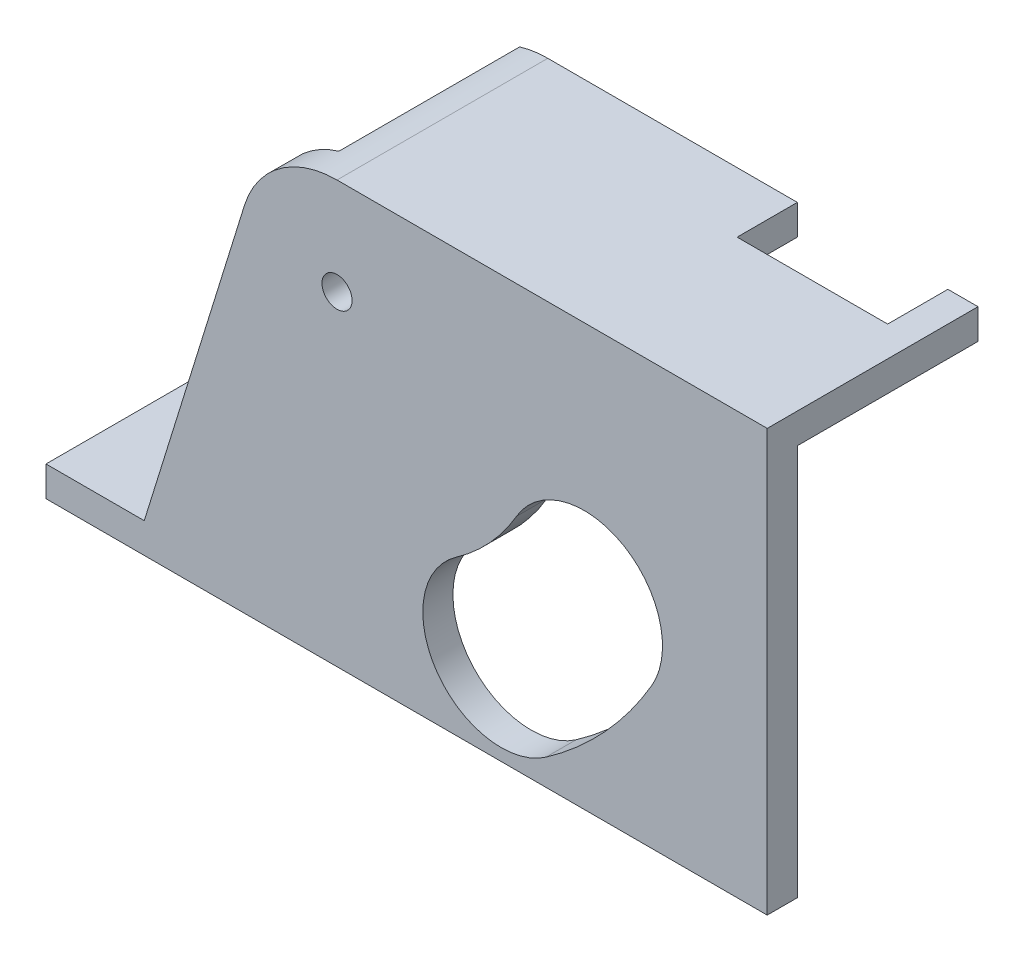
ISO-10303-21;
HEADER;
FILE_DESCRIPTION(('STEP AP214'),'2;1');
FILE_NAME('part.step','',(''),(''),'','','');
FILE_SCHEMA(('AUTOMOTIVE_DESIGN { 1 0 10303 214 1 1 1 1 }'));
ENDSEC;
DATA;
#1=APPLICATION_CONTEXT('core data for automotive mechanical design processes');
#2=APPLICATION_PROTOCOL_DEFINITION('international standard','automotive_design',2000,#1);
#3=PRODUCT_CONTEXT('',#1,'mechanical');
#4=PRODUCT('Part','Part','',(#3));
#5=PRODUCT_RELATED_PRODUCT_CATEGORY('part','',(#4));
#6=PRODUCT_DEFINITION_FORMATION('','',#4);
#7=PRODUCT_DEFINITION_CONTEXT('part definition',#1,'design');
#8=PRODUCT_DEFINITION('design','',#6,#7);
#9=PRODUCT_DEFINITION_SHAPE('','',#8);
#10=(LENGTH_UNIT() NAMED_UNIT(*) SI_UNIT(.MILLI.,.METRE.));
#11=(NAMED_UNIT(*) PLANE_ANGLE_UNIT() SI_UNIT($,.RADIAN.));
#12=(NAMED_UNIT(*) SI_UNIT($,.STERADIAN.) SOLID_ANGLE_UNIT());
#13=UNCERTAINTY_MEASURE_WITH_UNIT(LENGTH_MEASURE(1.E-05),#10,'distance_accuracy_value','');
#14=(GEOMETRIC_REPRESENTATION_CONTEXT(3) GLOBAL_UNCERTAINTY_ASSIGNED_CONTEXT((#13)) GLOBAL_UNIT_ASSIGNED_CONTEXT((#10,
#11,#12)) REPRESENTATION_CONTEXT('',''));
#15=CARTESIAN_POINT('',(0.,0.,0.));
#16=DIRECTION('',(0.,0.,1.));
#17=DIRECTION('',(1.,0.,0.));
#18=AXIS2_PLACEMENT_3D('',#15,#16,#17);
#19=CARTESIAN_POINT('',(48.5613886077065,58.9097221037272,-30.));
#20=DIRECTION('',(0.,0.,1.));
#21=DIRECTION('',(1.,0.,0.));
#22=AXIS2_PLACEMENT_3D('',#19,#20,#21);
#23=PLANE('',#22);
#24=DIRECTION('',(-1.,0.,0.));
#25=VECTOR('',#24,1.);
#26=CARTESIAN_POINT('',(120.,65.,-30.));
#27=LINE('',#26,#25);
#28=CARTESIAN_POINT('',(120.,65.,-30.));
#29=VERTEX_POINT('',#28);
#30=CARTESIAN_POINT('',(115.,65.,-30.));
#31=VERTEX_POINT('',#30);
#32=EDGE_CURVE('E200',#29,#31,#27,.T.);
#33=ORIENTED_EDGE('',*,*,#32,.T.);
#34=DIRECTION('',(0.,1.,0.));
#35=VECTOR('',#34,1.);
#36=CARTESIAN_POINT('',(115.,58.9097221037273,-30.));
#37=LINE('',#36,#35);
#38=CARTESIAN_POINT('',(115.,70.,-30.));
#39=VERTEX_POINT('',#38);
#40=EDGE_CURVE('E41',#31,#39,#37,.T.);
#41=ORIENTED_EDGE('',*,*,#40,.T.);
#42=DIRECTION('',(1.,0.,0.));
#43=VECTOR('',#42,1.);
#44=CARTESIAN_POINT('',(120.,70.,-30.));
#45=LINE('',#44,#43);
#46=CARTESIAN_POINT('',(120.,70.,-30.));
#47=VERTEX_POINT('',#46);
#48=EDGE_CURVE('E198',#39,#47,#45,.T.);
#49=ORIENTED_EDGE('',*,*,#48,.T.);
#50=DIRECTION('',(0.,-1.,0.));
#51=VECTOR('',#50,1.);
#52=CARTESIAN_POINT('',(120.,70.,-30.));
#53=LINE('',#52,#51);
#54=EDGE_CURVE('E226',#47,#29,#53,.T.);
#55=ORIENTED_EDGE('',*,*,#54,.T.);
#56=EDGE_LOOP('',(#33,#41,#49,#55));
#57=FACE_BOUND('',#56,.T.);
#58=ADVANCED_FACE('F33',(#57),#23,.F.);
#59=CARTESIAN_POINT('',(0.,0.,0.));
#60=DIRECTION('',(0.,0.,-1.));
#61=DIRECTION('',(-1.,0.,0.));
#62=AXIS2_PLACEMENT_3D('',#59,#60,#61);
#63=PLANE('',#62);
#64=CARTESIAN_POINT('',(75.8062693343812,15.,0.));
#65=DIRECTION('',(0.,0.,1.));
#66=DIRECTION('',(1.,0.,0.));
#67=AXIS2_PLACEMENT_3D('',#64,#65,#66);
#68=CIRCLE('',#67,13.);
#69=CARTESIAN_POINT('',(68.3497756618176,25.6489765757569,0.));
#70=VERTEX_POINT('',#69);
#71=CARTESIAN_POINT('',(83.2627630069448,4.35102342424313,0.));
#72=VERTEX_POINT('',#71);
#73=EDGE_CURVE('E252',#70,#72,#68,.T.);
#74=ORIENTED_EDGE('',*,*,#73,.T.);
#75=CARTESIAN_POINT('',(48.5613886077065,53.9097221037271,0.));
#76=DIRECTION('',(0.,0.,1.));
#77=DIRECTION('',(1.,0.,0.));
#78=AXIS2_PLACEMENT_3D('',#75,#76,#77);
#79=CIRCLE('',#78,60.5);
#80=CARTESIAN_POINT('',(100.837944203235,23.4562865821378,0.));
#81=VERTEX_POINT('',#80);
#82=EDGE_CURVE('E255',#72,#81,#79,.T.);
#83=ORIENTED_EDGE('',*,*,#82,.T.);
#84=CARTESIAN_POINT('',(89.6049653149398,30.,0.));
#85=DIRECTION('',(0.,0.,1.));
#86=DIRECTION('',(1.,0.,0.));
#87=AXIS2_PLACEMENT_3D('',#84,#85,#86);
#88=CIRCLE('',#87,13.);
#89=CARTESIAN_POINT('',(78.3719864266444,36.5437134178622,0.));
#90=VERTEX_POINT('',#89);
#91=EDGE_CURVE('E259',#81,#90,#88,.T.);
#92=ORIENTED_EDGE('',*,*,#91,.T.);
#93=CARTESIAN_POINT('',(48.5613886077065,53.9097221037271,0.));
#94=DIRECTION('',(0.,0.,-1.));
#95=DIRECTION('',(1.,0.,0.));
#96=AXIS2_PLACEMENT_3D('',#93,#94,#95);
#97=CIRCLE('',#96,34.5);
#98=EDGE_CURVE('E262',#90,#70,#97,.T.);
#99=ORIENTED_EDGE('',*,*,#98,.T.);
#100=EDGE_LOOP('',(#74,#83,#92,#99));
#101=FACE_BOUND('',#100,.T.);
#102=CARTESIAN_POINT('',(48.5613886077065,53.9097221037271,0.));
#103=DIRECTION('',(0.,0.,1.));
#104=DIRECTION('',(1.,0.,0.));
#105=AXIS2_PLACEMENT_3D('',#102,#103,#104);
#106=CIRCLE('',#105,2.5);
#107=CARTESIAN_POINT('',(51.0613886077065,53.9097221037271,0.));
#108=VERTEX_POINT('',#107);
#109=EDGE_CURVE('E269',#108,#108,#106,.T.);
#110=ORIENTED_EDGE('',*,*,#109,.T.);
#111=EDGE_LOOP('',(#110));
#112=FACE_BOUND('',#111,.T.);
#113=DIRECTION('',(-0.296153592749173,-0.9551403297431,0.));
#114=VECTOR('',#113,1.);
#115=CARTESIAN_POINT('',(37.2069506060173,54.7376581656054,0.));
#116=LINE('',#115,#114);
#117=CARTESIAN_POINT('',(37.2069506060173,54.7376581656054,0.));
#118=VERTEX_POINT('',#117);
#119=CARTESIAN_POINT('',(20.2348328766987,0.,0.));
#120=VERTEX_POINT('',#119);
#121=EDGE_CURVE('E363',#118,#120,#116,.T.);
#122=ORIENTED_EDGE('',*,*,#121,.F.);
#123=DIRECTION('',(0.864075299099649,-0.503362570604781,0.));
#124=VECTOR('',#123,1.);
#125=CARTESIAN_POINT('',(37.2069506060173,54.7376581656054,0.));
#126=LINE('',#125,#124);
#127=CARTESIAN_POINT('',(32.7730020651153,57.320631822882,0.));
#128=VERTEX_POINT('',#127);
#129=EDGE_CURVE('E359',#128,#118,#126,.T.);
#130=ORIENTED_EDGE('',*,*,#129,.F.);
#131=DIRECTION('',(-0.296153592749172,-0.9551403297431,0.));
#132=VECTOR('',#131,1.);
#133=CARTESIAN_POINT('',(13.6843957425264,-4.24302360349572,0.));
#134=LINE('',#133,#132);
#135=CARTESIAN_POINT('',(33.1929152722023,58.6749157110409,0.));
#136=VERTEX_POINT('',#135);
#137=EDGE_CURVE('E302',#136,#128,#134,.T.);
#138=ORIENTED_EDGE('',*,*,#137,.F.);
#139=CARTESIAN_POINT('',(48.5613886077065,53.9097221037271,0.));
#140=DIRECTION('',(0.,0.,-1.));
#141=DIRECTION('',(-1.,0.,0.));
#142=AXIS2_PLACEMENT_3D('',#139,#140,#141);
#143=CIRCLE('',#142,16.0902778962729);
#144=CARTESIAN_POINT('',(43.8850469520508,69.3054640962024,0.));
#145=VERTEX_POINT('',#144);
#146=EDGE_CURVE('E305',#145,#136,#143,.F.);
#147=ORIENTED_EDGE('',*,*,#146,.F.);
#148=DIRECTION('',(-0.573576436351043,0.819152044288994,0.));
#149=VECTOR('',#148,1.);
#150=CARTESIAN_POINT('',(47.0357374309038,64.8058117689672,0.));
#151=LINE('',#150,#149);
#152=CARTESIAN_POINT('',(47.0357374309038,64.8058117689672,0.));
#153=VERTEX_POINT('',#152);
#154=EDGE_CURVE('E223',#153,#145,#151,.T.);
#155=ORIENTED_EDGE('',*,*,#154,.F.);
#156=CARTESIAN_POINT('',(48.5613886077065,58.9097221037272,0.));
#157=DIRECTION('',(0.,0.,1.));
#158=DIRECTION('',(1.,0.,0.));
#159=AXIS2_PLACEMENT_3D('',#156,#157,#158);
#160=CIRCLE('',#159,6.09027789627276);
#161=CARTESIAN_POINT('',(48.5613886077065,65.,0.));
#162=VERTEX_POINT('',#161);
#163=EDGE_CURVE('E219',#162,#153,#160,.T.);
#164=ORIENTED_EDGE('',*,*,#163,.F.);
#165=DIRECTION('',(-1.,0.,0.));
#166=VECTOR('',#165,1.);
#167=CARTESIAN_POINT('',(120.,65.,0.));
#168=LINE('',#167,#166);
#169=CARTESIAN_POINT('',(120.,65.,0.));
#170=VERTEX_POINT('',#169);
#171=EDGE_CURVE('E216',#170,#162,#168,.T.);
#172=ORIENTED_EDGE('',*,*,#171,.F.);
#173=DIRECTION('',(0.,1.,0.));
#174=VECTOR('',#173,1.);
#175=CARTESIAN_POINT('',(120.,0.,0.));
#176=LINE('',#175,#174);
#177=CARTESIAN_POINT('',(120.,0.,0.));
#178=VERTEX_POINT('',#177);
#179=EDGE_CURVE('E293',#178,#170,#176,.T.);
#180=ORIENTED_EDGE('',*,*,#179,.F.);
#181=DIRECTION('',(1.,0.,0.));
#182=VECTOR('',#181,1.);
#183=CARTESIAN_POINT('',(0.,0.,0.));
#184=LINE('',#183,#182);
#185=EDGE_CURVE('E279',#120,#178,#184,.T.);
#186=ORIENTED_EDGE('',*,*,#185,.F.);
#187=EDGE_LOOP('',(#122,#130,#138,#147,#155,#164,#172,#180,#186));
#188=FACE_BOUND('',#187,.T.);
#189=ADVANCED_FACE('F387',(#101,#112,#188),#63,.T.);
#190=CARTESIAN_POINT('',(0.,0.,5.));
#191=DIRECTION('',(0.,1.,0.));
#192=DIRECTION('',(0.,0.,1.));
#193=AXIS2_PLACEMENT_3D('',#190,#191,#192);
#194=PLANE('',#193);
#195=DIRECTION('',(0.,0.,-1.));
#196=VECTOR('',#195,1.);
#197=CARTESIAN_POINT('',(120.,0.,5.));
#198=LINE('',#197,#196);
#199=CARTESIAN_POINT('',(120.,0.,5.));
#200=VERTEX_POINT('',#199);
#201=EDGE_CURVE('E296',#200,#178,#198,.T.);
#202=ORIENTED_EDGE('',*,*,#201,.F.);
#203=DIRECTION('',(1.,0.,0.));
#204=VECTOR('',#203,1.);
#205=CARTESIAN_POINT('',(0.,0.,5.));
#206=LINE('',#205,#204);
#207=CARTESIAN_POINT('',(0.234832876698662,0.,5.));
#208=VERTEX_POINT('',#207);
#209=EDGE_CURVE('E290',#208,#200,#206,.T.);
#210=ORIENTED_EDGE('',*,*,#209,.F.);
#211=DIRECTION('',(0.,0.,-1.));
#212=VECTOR('',#211,1.);
#213=CARTESIAN_POINT('',(0.234832876698662,0.,5.));
#214=LINE('',#213,#212);
#215=CARTESIAN_POINT('',(0.234832876698662,0.,-30.));
#216=VERTEX_POINT('',#215);
#217=EDGE_CURVE('E349',#208,#216,#214,.T.);
#218=ORIENTED_EDGE('',*,*,#217,.T.);
#219=DIRECTION('',(-1.,0.,0.));
#220=VECTOR('',#219,1.);
#221=CARTESIAN_POINT('',(20.2348328766987,0.,-30.));
#222=LINE('',#221,#220);
#223=CARTESIAN_POINT('',(20.2348328766987,0.,-30.));
#224=VERTEX_POINT('',#223);
#225=EDGE_CURVE('E360',#224,#216,#222,.T.);
#226=ORIENTED_EDGE('',*,*,#225,.F.);
#227=DIRECTION('',(0.,0.,1.));
#228=VECTOR('',#227,1.);
#229=CARTESIAN_POINT('',(20.2348328766987,0.,-30.));
#230=LINE('',#229,#228);
#231=EDGE_CURVE('E369',#224,#120,#230,.T.);
#232=ORIENTED_EDGE('',*,*,#231,.T.);
#233=ORIENTED_EDGE('',*,*,#185,.T.);
#234=EDGE_LOOP('',(#202,#210,#218,#226,#232,#233));
#235=FACE_BOUND('',#234,.T.);
#236=ADVANCED_FACE('F35',(#235),#194,.F.);
#237=CARTESIAN_POINT('',(120.,0.,5.));
#238=DIRECTION('',(-1.,0.,0.));
#239=DIRECTION('',(0.,-1.,0.));
#240=AXIS2_PLACEMENT_3D('',#237,#238,#239);
#241=PLANE('',#240);
#242=ORIENTED_EDGE('',*,*,#179,.T.);
#243=DIRECTION('',(0.,0.,1.));
#244=VECTOR('',#243,1.);
#245=CARTESIAN_POINT('',(120.,65.,-30.));
#246=LINE('',#245,#244);
#247=EDGE_CURVE('E235',#29,#170,#246,.T.);
#248=ORIENTED_EDGE('',*,*,#247,.F.);
#249=ORIENTED_EDGE('',*,*,#54,.F.);
#250=DIRECTION('',(0.,0.,1.));
#251=VECTOR('',#250,1.);
#252=CARTESIAN_POINT('',(120.,70.,-5.));
#253=LINE('',#252,#251);
#254=CARTESIAN_POINT('',(120.,70.,5.));
#255=VERTEX_POINT('',#254);
#256=EDGE_CURVE('E204',#47,#255,#253,.T.);
#257=ORIENTED_EDGE('',*,*,#256,.T.);
#258=DIRECTION('',(0.,1.,0.));
#259=VECTOR('',#258,1.);
#260=CARTESIAN_POINT('',(120.,0.,5.));
#261=LINE('',#260,#259);
#262=EDGE_CURVE('E292',#200,#255,#261,.T.);
#263=ORIENTED_EDGE('',*,*,#262,.F.);
#264=ORIENTED_EDGE('',*,*,#201,.T.);
#265=EDGE_LOOP('',(#242,#248,#249,#257,#263,#264));
#266=FACE_BOUND('',#265,.T.);
#267=ADVANCED_FACE('F400',(#266),#241,.F.);
#268=CARTESIAN_POINT('',(0.,0.,5.));
#269=DIRECTION('',(0.,0.,-1.));
#270=DIRECTION('',(-1.,0.,0.));
#271=AXIS2_PLACEMENT_3D('',#268,#269,#270);
#272=PLANE('',#271);
#273=ORIENTED_EDGE('',*,*,#209,.T.);
#274=ORIENTED_EDGE('',*,*,#262,.T.);
#275=DIRECTION('',(1.,0.,0.));
#276=VECTOR('',#275,1.);
#277=CARTESIAN_POINT('',(120.,70.,5.));
#278=LINE('',#277,#276);
#279=CARTESIAN_POINT('',(48.5613886077065,70.,5.));
#280=VERTEX_POINT('',#279);
#281=EDGE_CURVE('E243',#280,#255,#278,.T.);
#282=ORIENTED_EDGE('',*,*,#281,.F.);
#283=CARTESIAN_POINT('',(48.5613886077065,53.9097221037271,5.));
#284=DIRECTION('',(0.,0.,-1.));
#285=DIRECTION('',(1.,0.,0.));
#286=AXIS2_PLACEMENT_3D('',#283,#284,#285);
#287=CIRCLE('',#286,16.0902778962729);
#288=CARTESIAN_POINT('',(33.1929152722023,58.6749157110409,5.));
#289=VERTEX_POINT('',#288);
#290=EDGE_CURVE('E240',#289,#280,#287,.T.);
#291=ORIENTED_EDGE('',*,*,#290,.F.);
#292=DIRECTION('',(0.296153592749172,0.9551403297431,0.));
#293=VECTOR('',#292,1.);
#294=CARTESIAN_POINT('',(33.1929152722023,58.6749157110409,5.));
#295=LINE('',#294,#293);
#296=CARTESIAN_POINT('',(16.5503145638758,4.99999999999999,5.));
#297=VERTEX_POINT('',#296);
#298=EDGE_CURVE('E238',#297,#289,#295,.T.);
#299=ORIENTED_EDGE('',*,*,#298,.F.);
#300=DIRECTION('',(1.,0.,0.));
#301=VECTOR('',#300,1.);
#302=CARTESIAN_POINT('',(20.2348328766987,5.,5.));
#303=LINE('',#302,#301);
#304=CARTESIAN_POINT('',(0.234832876698662,5.,5.));
#305=VERTEX_POINT('',#304);
#306=EDGE_CURVE('E347',#305,#297,#303,.T.);
#307=ORIENTED_EDGE('',*,*,#306,.F.);
#308=DIRECTION('',(0.,1.,0.));
#309=VECTOR('',#308,1.);
#310=CARTESIAN_POINT('',(0.234832876698662,0.,5.));
#311=LINE('',#310,#309);
#312=EDGE_CURVE('E344',#208,#305,#311,.T.);
#313=ORIENTED_EDGE('',*,*,#312,.F.);
#314=EDGE_LOOP('',(#273,#274,#282,#291,#299,#307,#313));
#315=FACE_BOUND('',#314,.T.);
#316=CARTESIAN_POINT('',(48.5613886077065,53.9097221037271,5.));
#317=DIRECTION('',(0.,0.,1.));
#318=DIRECTION('',(1.,0.,0.));
#319=AXIS2_PLACEMENT_3D('',#316,#317,#318);
#320=CIRCLE('',#319,60.5);
#321=CARTESIAN_POINT('',(83.2627630069448,4.35102342424313,5.));
#322=VERTEX_POINT('',#321);
#323=CARTESIAN_POINT('',(100.837944203235,23.4562865821378,5.));
#324=VERTEX_POINT('',#323);
#325=EDGE_CURVE('E268',#322,#324,#320,.T.);
#326=ORIENTED_EDGE('',*,*,#325,.F.);
#327=CARTESIAN_POINT('',(75.8062693343812,15.,5.));
#328=DIRECTION('',(0.,0.,1.));
#329=DIRECTION('',(1.,0.,0.));
#330=AXIS2_PLACEMENT_3D('',#327,#328,#329);
#331=CIRCLE('',#330,13.);
#332=CARTESIAN_POINT('',(68.3497756618176,25.6489765757569,5.));
#333=VERTEX_POINT('',#332);
#334=EDGE_CURVE('E266',#333,#322,#331,.T.);
#335=ORIENTED_EDGE('',*,*,#334,.F.);
#336=CARTESIAN_POINT('',(48.5613886077065,53.9097221037271,5.));
#337=DIRECTION('',(0.,0.,-1.));
#338=DIRECTION('',(1.,0.,0.));
#339=AXIS2_PLACEMENT_3D('',#336,#337,#338);
#340=CIRCLE('',#339,34.5);
#341=CARTESIAN_POINT('',(78.3719864266444,36.5437134178622,5.));
#342=VERTEX_POINT('',#341);
#343=EDGE_CURVE('E256',#342,#333,#340,.T.);
#344=ORIENTED_EDGE('',*,*,#343,.F.);
#345=CARTESIAN_POINT('',(89.6049653149398,30.,5.));
#346=DIRECTION('',(0.,0.,1.));
#347=DIRECTION('',(1.,0.,0.));
#348=AXIS2_PLACEMENT_3D('',#345,#346,#347);
#349=CIRCLE('',#348,13.);
#350=EDGE_CURVE('E272',#324,#342,#349,.T.);
#351=ORIENTED_EDGE('',*,*,#350,.F.);
#352=EDGE_LOOP('',(#326,#335,#344,#351));
#353=FACE_BOUND('',#352,.T.);
#354=CARTESIAN_POINT('',(48.5613886077065,53.9097221037271,5.));
#355=DIRECTION('',(0.,0.,1.));
#356=DIRECTION('',(1.,0.,0.));
#357=AXIS2_PLACEMENT_3D('',#354,#355,#356);
#358=CIRCLE('',#357,2.5);
#359=CARTESIAN_POINT('',(51.0613886077065,53.9097221037271,5.));
#360=VERTEX_POINT('',#359);
#361=EDGE_CURVE('E247',#360,#360,#358,.T.);
#362=ORIENTED_EDGE('',*,*,#361,.F.);
#363=EDGE_LOOP('',(#362));
#364=FACE_BOUND('',#363,.T.);
#365=ADVANCED_FACE('F393',(#315,#353,#364),#272,.F.);
#366=CARTESIAN_POINT('',(48.5613886077065,53.9097221037271,0.));
#367=DIRECTION('',(0.,0.,1.));
#368=DIRECTION('',(1.,0.,0.));
#369=AXIS2_PLACEMENT_3D('',#366,#367,#368);
#370=CYLINDRICAL_SURFACE('',#369,2.5);
#371=ORIENTED_EDGE('',*,*,#109,.F.);
#372=EDGE_LOOP('',(#371));
#373=FACE_BOUND('',#372,.T.);
#374=ORIENTED_EDGE('',*,*,#361,.T.);
#375=EDGE_LOOP('',(#374));
#376=FACE_BOUND('',#375,.T.);
#377=ADVANCED_FACE('F460',(#373,#376),#370,.F.);
#378=CARTESIAN_POINT('',(75.8062693343812,15.,0.));
#379=DIRECTION('',(0.,0.,1.));
#380=DIRECTION('',(1.,0.,0.));
#381=AXIS2_PLACEMENT_3D('',#378,#379,#380);
#382=CYLINDRICAL_SURFACE('',#381,13.);
#383=ORIENTED_EDGE('',*,*,#334,.T.);
#384=DIRECTION('',(0.,0.,1.));
#385=VECTOR('',#384,1.);
#386=CARTESIAN_POINT('',(83.2627630069448,4.35102342424313,0.));
#387=LINE('',#386,#385);
#388=EDGE_CURVE('E265',#72,#322,#387,.T.);
#389=ORIENTED_EDGE('',*,*,#388,.F.);
#390=ORIENTED_EDGE('',*,*,#73,.F.);
#391=DIRECTION('',(0.,0.,1.));
#392=VECTOR('',#391,1.);
#393=CARTESIAN_POINT('',(68.3497756618176,25.6489765757569,0.));
#394=LINE('',#393,#392);
#395=EDGE_CURVE('E277',#70,#333,#394,.T.);
#396=ORIENTED_EDGE('',*,*,#395,.T.);
#397=EDGE_LOOP('',(#383,#389,#390,#396));
#398=FACE_BOUND('',#397,.T.);
#399=ADVANCED_FACE('F450',(#398),#382,.F.);
#400=CARTESIAN_POINT('',(48.5613886077065,53.9097221037271,0.));
#401=DIRECTION('',(0.,0.,1.));
#402=DIRECTION('',(1.,0.,0.));
#403=AXIS2_PLACEMENT_3D('',#400,#401,#402);
#404=CYLINDRICAL_SURFACE('',#403,34.5);
#405=ORIENTED_EDGE('',*,*,#343,.T.);
#406=ORIENTED_EDGE('',*,*,#395,.F.);
#407=ORIENTED_EDGE('',*,*,#98,.F.);
#408=DIRECTION('',(0.,0.,1.));
#409=VECTOR('',#408,1.);
#410=CARTESIAN_POINT('',(78.3719864266444,36.5437134178622,0.));
#411=LINE('',#410,#409);
#412=EDGE_CURVE('E280',#90,#342,#411,.T.);
#413=ORIENTED_EDGE('',*,*,#412,.T.);
#414=EDGE_LOOP('',(#405,#406,#407,#413));
#415=FACE_BOUND('',#414,.T.);
#416=ADVANCED_FACE('F446',(#415),#404,.T.);
#417=CARTESIAN_POINT('',(89.6049653149398,30.,0.));
#418=DIRECTION('',(0.,0.,1.));
#419=DIRECTION('',(1.,0.,0.));
#420=AXIS2_PLACEMENT_3D('',#417,#418,#419);
#421=CYLINDRICAL_SURFACE('',#420,13.);
#422=ORIENTED_EDGE('',*,*,#350,.T.);
#423=ORIENTED_EDGE('',*,*,#412,.F.);
#424=ORIENTED_EDGE('',*,*,#91,.F.);
#425=DIRECTION('',(0.,0.,1.));
#426=VECTOR('',#425,1.);
#427=CARTESIAN_POINT('',(100.837944203235,23.4562865821378,0.));
#428=LINE('',#427,#426);
#429=EDGE_CURVE('E282',#81,#324,#428,.T.);
#430=ORIENTED_EDGE('',*,*,#429,.T.);
#431=EDGE_LOOP('',(#422,#423,#424,#430));
#432=FACE_BOUND('',#431,.T.);
#433=ADVANCED_FACE('F449',(#432),#421,.F.);
#434=CARTESIAN_POINT('',(48.5613886077065,53.9097221037271,0.));
#435=DIRECTION('',(0.,0.,1.));
#436=DIRECTION('',(1.,0.,0.));
#437=AXIS2_PLACEMENT_3D('',#434,#435,#436);
#438=CYLINDRICAL_SURFACE('',#437,60.5);
#439=ORIENTED_EDGE('',*,*,#325,.T.);
#440=ORIENTED_EDGE('',*,*,#429,.F.);
#441=ORIENTED_EDGE('',*,*,#82,.F.);
#442=ORIENTED_EDGE('',*,*,#388,.T.);
#443=EDGE_LOOP('',(#439,#440,#441,#442));
#444=FACE_BOUND('',#443,.T.);
#445=ADVANCED_FACE('F441',(#444),#438,.F.);
#446=CARTESIAN_POINT('',(120.,70.,-5.));
#447=DIRECTION('',(0.,-1.,0.));
#448=DIRECTION('',(1.,0.,0.));
#449=AXIS2_PLACEMENT_3D('',#446,#447,#448);
#450=PLANE('',#449);
#451=ORIENTED_EDGE('',*,*,#48,.F.);
#452=DIRECTION('',(0.,0.,-1.));
#453=VECTOR('',#452,1.);
#454=CARTESIAN_POINT('',(115.,70.,-30.));
#455=LINE('',#454,#453);
#456=CARTESIAN_POINT('',(115.,70.,-20.));
#457=VERTEX_POINT('',#456);
#458=EDGE_CURVE('E183',#457,#39,#455,.T.);
#459=ORIENTED_EDGE('',*,*,#458,.F.);
#460=DIRECTION('',(1.,0.,0.));
#461=VECTOR('',#460,1.);
#462=CARTESIAN_POINT('',(115.,70.,-20.));
#463=LINE('',#462,#461);
#464=CARTESIAN_POINT('',(90.,70.,-20.));
#465=VERTEX_POINT('',#464);
#466=EDGE_CURVE('E333',#465,#457,#463,.T.);
#467=ORIENTED_EDGE('',*,*,#466,.F.);
#468=DIRECTION('',(0.,0.,1.));
#469=VECTOR('',#468,1.);
#470=CARTESIAN_POINT('',(90.,70.,-30.));
#471=LINE('',#470,#469);
#472=CARTESIAN_POINT('',(90.,70.,-30.));
#473=VERTEX_POINT('',#472);
#474=EDGE_CURVE('E193',#473,#465,#471,.T.);
#475=ORIENTED_EDGE('',*,*,#474,.F.);
#476=CARTESIAN_POINT('',(48.5613886077065,70.,-30.));
#477=VERTEX_POINT('',#476);
#478=EDGE_CURVE('E206',#477,#473,#45,.T.);
#479=ORIENTED_EDGE('',*,*,#478,.F.);
#480=DIRECTION('',(0.,0.,1.));
#481=VECTOR('',#480,1.);
#482=CARTESIAN_POINT('',(48.5613886077065,70.,-5.));
#483=LINE('',#482,#481);
#484=EDGE_CURVE('E248',#477,#280,#483,.T.);
#485=ORIENTED_EDGE('',*,*,#484,.T.);
#486=ORIENTED_EDGE('',*,*,#281,.T.);
#487=ORIENTED_EDGE('',*,*,#256,.F.);
#488=EDGE_LOOP('',(#451,#459,#467,#475,#479,#485,#486,#487));
#489=FACE_BOUND('',#488,.T.);
#490=ADVANCED_FACE('F202',(#489),#450,.F.);
#491=CARTESIAN_POINT('',(48.5613886077065,53.9097221037271,-5.));
#492=DIRECTION('',(0.,0.,1.));
#493=DIRECTION('',(1.,0.,0.));
#494=AXIS2_PLACEMENT_3D('',#491,#492,#493);
#495=CYLINDRICAL_SURFACE('',#494,16.0902778962729);
#496=ORIENTED_EDGE('',*,*,#484,.F.);
#497=CARTESIAN_POINT('',(48.5613886077065,53.9097221037275,-30.));
#498=DIRECTION('',(0.,0.,-1.));
#499=DIRECTION('',(1.,0.,0.));
#500=AXIS2_PLACEMENT_3D('',#497,#498,#499);
#501=CIRCLE('',#500,16.0902778962725);
#502=CARTESIAN_POINT('',(43.8850469520508,69.3054640962024,-30.));
#503=VERTEX_POINT('',#502);
#504=EDGE_CURVE('E207',#503,#477,#501,.T.);
#505=ORIENTED_EDGE('',*,*,#504,.F.);
#506=DIRECTION('',(0.,0.,1.));
#507=VECTOR('',#506,1.);
#508=CARTESIAN_POINT('',(43.8850469520508,69.3054640962024,-30.));
#509=LINE('',#508,#507);
#510=EDGE_CURVE('E210',#503,#145,#509,.T.);
#511=ORIENTED_EDGE('',*,*,#510,.T.);
#512=ORIENTED_EDGE('',*,*,#146,.T.);
#513=DIRECTION('',(0.,0.,1.));
#514=VECTOR('',#513,1.);
#515=CARTESIAN_POINT('',(33.1929152722023,58.6749157110409,-5.));
#516=LINE('',#515,#514);
#517=EDGE_CURVE('E245',#136,#289,#516,.T.);
#518=ORIENTED_EDGE('',*,*,#517,.T.);
#519=ORIENTED_EDGE('',*,*,#290,.T.);
#520=EDGE_LOOP('',(#496,#505,#511,#512,#518,#519));
#521=FACE_BOUND('',#520,.T.);
#522=ADVANCED_FACE('F330',(#521),#495,.T.);
#523=CARTESIAN_POINT('',(33.1929152722023,58.6749157110409,-5.));
#524=DIRECTION('',(0.9551403297431,-0.296153592749172,0.));
#525=DIRECTION('',(0.296153592749172,0.9551403297431,0.));
#526=AXIS2_PLACEMENT_3D('',#523,#524,#525);
#527=PLANE('',#526);
#528=DIRECTION('',(0.296153592749172,0.9551403297431,0.));
#529=VECTOR('',#528,1.);
#530=CARTESIAN_POINT('',(15.,0.,-30.));
#531=LINE('',#530,#529);
#532=CARTESIAN_POINT('',(16.5503145638758,5.,-30.));
#533=VERTEX_POINT('',#532);
#534=CARTESIAN_POINT('',(32.7730020651153,57.320631822882,-30.));
#535=VERTEX_POINT('',#534);
#536=EDGE_CURVE('E362',#533,#535,#531,.T.);
#537=ORIENTED_EDGE('',*,*,#536,.F.);
#538=DIRECTION('',(0.,0.,1.));
#539=VECTOR('',#538,1.);
#540=CARTESIAN_POINT('',(16.5503145638758,5.,-5.));
#541=LINE('',#540,#539);
#542=EDGE_CURVE('E354',#533,#297,#541,.T.);
#543=ORIENTED_EDGE('',*,*,#542,.T.);
#544=ORIENTED_EDGE('',*,*,#298,.T.);
#545=ORIENTED_EDGE('',*,*,#517,.F.);
#546=ORIENTED_EDGE('',*,*,#137,.T.);
#547=DIRECTION('',(0.,0.,1.));
#548=VECTOR('',#547,1.);
#549=CARTESIAN_POINT('',(32.7730020651153,57.320631822882,-30.));
#550=LINE('',#549,#548);
#551=EDGE_CURVE('E220',#535,#128,#550,.T.);
#552=ORIENTED_EDGE('',*,*,#551,.F.);
#553=EDGE_LOOP('',(#537,#543,#544,#545,#546,#552));
#554=FACE_BOUND('',#553,.T.);
#555=ADVANCED_FACE('F390',(#554),#527,.F.);
#556=CARTESIAN_POINT('',(120.,65.,-30.));
#557=DIRECTION('',(0.,1.,0.));
#558=DIRECTION('',(0.,0.,1.));
#559=AXIS2_PLACEMENT_3D('',#556,#557,#558);
#560=PLANE('',#559);
#561=DIRECTION('',(1.,0.,0.));
#562=VECTOR('',#561,1.);
#563=CARTESIAN_POINT('',(120.,65.,-20.));
#564=LINE('',#563,#562);
#565=CARTESIAN_POINT('',(90.,65.,-20.));
#566=VERTEX_POINT('',#565);
#567=CARTESIAN_POINT('',(115.,65.,-20.));
#568=VERTEX_POINT('',#567);
#569=EDGE_CURVE('E11',#566,#568,#564,.T.);
#570=ORIENTED_EDGE('',*,*,#569,.T.);
#571=DIRECTION('',(0.,0.,-1.));
#572=VECTOR('',#571,1.);
#573=CARTESIAN_POINT('',(115.,65.,-30.));
#574=LINE('',#573,#572);
#575=EDGE_CURVE('E341',#568,#31,#574,.T.);
#576=ORIENTED_EDGE('',*,*,#575,.T.);
#577=ORIENTED_EDGE('',*,*,#32,.F.);
#578=ORIENTED_EDGE('',*,*,#247,.T.);
#579=ORIENTED_EDGE('',*,*,#171,.T.);
#580=DIRECTION('',(0.,0.,1.));
#581=VECTOR('',#580,1.);
#582=CARTESIAN_POINT('',(48.5613886077065,65.,-30.));
#583=LINE('',#582,#581);
#584=CARTESIAN_POINT('',(48.5613886077065,65.,-30.));
#585=VERTEX_POINT('',#584);
#586=EDGE_CURVE('E232',#585,#162,#583,.T.);
#587=ORIENTED_EDGE('',*,*,#586,.F.);
#588=CARTESIAN_POINT('',(90.,65.,-30.));
#589=VERTEX_POINT('',#588);
#590=EDGE_CURVE('E310',#589,#585,#27,.T.);
#591=ORIENTED_EDGE('',*,*,#590,.F.);
#592=DIRECTION('',(0.,0.,1.));
#593=VECTOR('',#592,1.);
#594=CARTESIAN_POINT('',(90.,65.,-30.));
#595=LINE('',#594,#593);
#596=EDGE_CURVE('E48',#589,#566,#595,.T.);
#597=ORIENTED_EDGE('',*,*,#596,.T.);
#598=EDGE_LOOP('',(#570,#576,#577,#578,#579,#587,#591,#597));
#599=FACE_BOUND('',#598,.T.);
#600=ADVANCED_FACE('F316',(#599),#560,.F.);
#601=CARTESIAN_POINT('',(48.5613886077065,58.9097221037272,-30.));
#602=DIRECTION('',(0.,0.,1.));
#603=DIRECTION('',(1.,0.,0.));
#604=AXIS2_PLACEMENT_3D('',#601,#602,#603);
#605=CYLINDRICAL_SURFACE('',#604,6.09027789627276);
#606=ORIENTED_EDGE('',*,*,#163,.T.);
#607=DIRECTION('',(0.,0.,1.));
#608=VECTOR('',#607,1.);
#609=CARTESIAN_POINT('',(47.0357374309038,64.8058117689672,-30.));
#610=LINE('',#609,#608);
#611=CARTESIAN_POINT('',(47.0357374309038,64.8058117689672,-30.));
#612=VERTEX_POINT('',#611);
#613=EDGE_CURVE('E229',#612,#153,#610,.T.);
#614=ORIENTED_EDGE('',*,*,#613,.F.);
#615=CARTESIAN_POINT('',(48.5613886077065,58.9097221037272,-30.));
#616=DIRECTION('',(0.,0.,1.));
#617=DIRECTION('',(1.,0.,0.));
#618=AXIS2_PLACEMENT_3D('',#615,#616,#617);
#619=CIRCLE('',#618,6.09027789627276);
#620=EDGE_CURVE('E319',#585,#612,#619,.T.);
#621=ORIENTED_EDGE('',*,*,#620,.F.);
#622=ORIENTED_EDGE('',*,*,#586,.T.);
#623=EDGE_LOOP('',(#606,#614,#621,#622));
#624=FACE_BOUND('',#623,.T.);
#625=ADVANCED_FACE('F432',(#624),#605,.F.);
#626=CARTESIAN_POINT('',(47.0357374309038,64.8058117689672,-30.));
#627=DIRECTION('',(0.819152044288994,0.573576436351043,0.));
#628=DIRECTION('',(-0.573576436351043,0.819152044288994,0.));
#629=AXIS2_PLACEMENT_3D('',#626,#627,#628);
#630=PLANE('',#629);
#631=ORIENTED_EDGE('',*,*,#154,.T.);
#632=ORIENTED_EDGE('',*,*,#510,.F.);
#633=DIRECTION('',(-0.573576436351043,0.819152044288994,0.));
#634=VECTOR('',#633,1.);
#635=CARTESIAN_POINT('',(47.0357374309038,64.8058117689672,-30.));
#636=LINE('',#635,#634);
#637=EDGE_CURVE('E212',#612,#503,#636,.T.);
#638=ORIENTED_EDGE('',*,*,#637,.F.);
#639=ORIENTED_EDGE('',*,*,#613,.T.);
#640=EDGE_LOOP('',(#631,#632,#638,#639));
#641=FACE_BOUND('',#640,.T.);
#642=ADVANCED_FACE('F328',(#641),#630,.F.);
#643=ORIENTED_EDGE('',*,*,#478,.T.);
#644=DIRECTION('',(0.,-1.,0.));
#645=VECTOR('',#644,1.);
#646=CARTESIAN_POINT('',(90.,58.9097221037273,-30.));
#647=LINE('',#646,#645);
#648=EDGE_CURVE('E201',#473,#589,#647,.T.);
#649=ORIENTED_EDGE('',*,*,#648,.T.);
#650=ORIENTED_EDGE('',*,*,#590,.T.);
#651=ORIENTED_EDGE('',*,*,#620,.T.);
#652=ORIENTED_EDGE('',*,*,#637,.T.);
#653=ORIENTED_EDGE('',*,*,#504,.T.);
#654=EDGE_LOOP('',(#643,#649,#650,#651,#652,#653));
#655=FACE_BOUND('',#654,.T.);
#656=ADVANCED_FACE('F309',(#655),#23,.F.);
#657=CARTESIAN_POINT('',(37.2069506060173,54.7376581656054,-30.));
#658=DIRECTION('',(-0.503362570604781,-0.864075299099649,0.));
#659=DIRECTION('',(0.864075299099649,-0.503362570604781,0.));
#660=AXIS2_PLACEMENT_3D('',#657,#658,#659);
#661=PLANE('',#660);
#662=ORIENTED_EDGE('',*,*,#129,.T.);
#663=DIRECTION('',(0.,0.,1.));
#664=VECTOR('',#663,1.);
#665=CARTESIAN_POINT('',(37.2069506060173,54.7376581656054,-30.));
#666=LINE('',#665,#664);
#667=CARTESIAN_POINT('',(37.2069506060173,54.7376581656054,-30.));
#668=VERTEX_POINT('',#667);
#669=EDGE_CURVE('E374',#668,#118,#666,.T.);
#670=ORIENTED_EDGE('',*,*,#669,.F.);
#671=DIRECTION('',(0.864075299099649,-0.503362570604781,0.));
#672=VECTOR('',#671,1.);
#673=CARTESIAN_POINT('',(37.2069506060173,54.7376581656054,-30.));
#674=LINE('',#673,#672);
#675=EDGE_CURVE('E365',#535,#668,#674,.T.);
#676=ORIENTED_EDGE('',*,*,#675,.F.);
#677=ORIENTED_EDGE('',*,*,#551,.T.);
#678=EDGE_LOOP('',(#662,#670,#676,#677));
#679=FACE_BOUND('',#678,.T.);
#680=ADVANCED_FACE('F380',(#679),#661,.F.);
#681=CARTESIAN_POINT('',(37.2069506060173,54.7376581656054,-30.));
#682=DIRECTION('',(-0.9551403297431,0.296153592749172,0.));
#683=DIRECTION('',(-0.296153592749173,-0.9551403297431,0.));
#684=AXIS2_PLACEMENT_3D('',#681,#682,#683);
#685=PLANE('',#684);
#686=ORIENTED_EDGE('',*,*,#121,.T.);
#687=ORIENTED_EDGE('',*,*,#231,.F.);
#688=DIRECTION('',(-0.296153592749173,-0.9551403297431,0.));
#689=VECTOR('',#688,1.);
#690=CARTESIAN_POINT('',(37.2069506060173,54.7376581656054,-30.));
#691=LINE('',#690,#689);
#692=EDGE_CURVE('E367',#668,#224,#691,.T.);
#693=ORIENTED_EDGE('',*,*,#692,.F.);
#694=ORIENTED_EDGE('',*,*,#669,.T.);
#695=EDGE_LOOP('',(#686,#687,#693,#694));
#696=FACE_BOUND('',#695,.T.);
#697=ADVANCED_FACE('F430',(#696),#685,.F.);
#698=CARTESIAN_POINT('',(0.,0.,-30.));
#699=DIRECTION('',(0.,0.,-1.));
#700=DIRECTION('',(-1.,0.,0.));
#701=AXIS2_PLACEMENT_3D('',#698,#699,#700);
#702=PLANE('',#701);
#703=ORIENTED_EDGE('',*,*,#692,.T.);
#704=ORIENTED_EDGE('',*,*,#225,.T.);
#705=DIRECTION('',(0.,1.,0.));
#706=VECTOR('',#705,1.);
#707=CARTESIAN_POINT('',(0.234832876698662,0.,-30.));
#708=LINE('',#707,#706);
#709=CARTESIAN_POINT('',(0.234832876698662,5.,-30.));
#710=VERTEX_POINT('',#709);
#711=EDGE_CURVE('E343',#216,#710,#708,.T.);
#712=ORIENTED_EDGE('',*,*,#711,.T.);
#713=DIRECTION('',(1.,0.,0.));
#714=VECTOR('',#713,1.);
#715=CARTESIAN_POINT('',(20.2348328766987,5.,-30.));
#716=LINE('',#715,#714);
#717=EDGE_CURVE('E56',#710,#533,#716,.T.);
#718=ORIENTED_EDGE('',*,*,#717,.T.);
#719=ORIENTED_EDGE('',*,*,#536,.T.);
#720=ORIENTED_EDGE('',*,*,#675,.T.);
#721=EDGE_LOOP('',(#703,#704,#712,#718,#719,#720));
#722=FACE_BOUND('',#721,.T.);
#723=ADVANCED_FACE('F478',(#722),#702,.T.);
#724=CARTESIAN_POINT('',(20.2348328766987,5.,5.));
#725=DIRECTION('',(0.,1.,0.));
#726=DIRECTION('',(0.,0.,1.));
#727=AXIS2_PLACEMENT_3D('',#724,#725,#726);
#728=PLANE('',#727);
#729=ORIENTED_EDGE('',*,*,#542,.F.);
#730=ORIENTED_EDGE('',*,*,#717,.F.);
#731=DIRECTION('',(0.,0.,-1.));
#732=VECTOR('',#731,1.);
#733=CARTESIAN_POINT('',(0.234832876698662,5.,5.));
#734=LINE('',#733,#732);
#735=EDGE_CURVE('E352',#305,#710,#734,.T.);
#736=ORIENTED_EDGE('',*,*,#735,.F.);
#737=ORIENTED_EDGE('',*,*,#306,.T.);
#738=EDGE_LOOP('',(#729,#730,#736,#737));
#739=FACE_BOUND('',#738,.T.);
#740=ADVANCED_FACE('F480',(#739),#728,.T.);
#741=CARTESIAN_POINT('',(0.234832876698662,0.,5.));
#742=DIRECTION('',(-1.,0.,0.));
#743=DIRECTION('',(0.,0.,1.));
#744=AXIS2_PLACEMENT_3D('',#741,#742,#743);
#745=PLANE('',#744);
#746=ORIENTED_EDGE('',*,*,#711,.F.);
#747=ORIENTED_EDGE('',*,*,#217,.F.);
#748=ORIENTED_EDGE('',*,*,#312,.T.);
#749=ORIENTED_EDGE('',*,*,#735,.T.);
#750=EDGE_LOOP('',(#746,#747,#748,#749));
#751=FACE_BOUND('',#750,.T.);
#752=ADVANCED_FACE('F483',(#751),#745,.T.);
#753=CARTESIAN_POINT('',(115.,0.,-20.));
#754=DIRECTION('',(0.,0.,1.));
#755=DIRECTION('',(1.,0.,0.));
#756=AXIS2_PLACEMENT_3D('',#753,#754,#755);
#757=PLANE('',#756);
#758=DIRECTION('',(0.,1.,0.));
#759=VECTOR('',#758,1.);
#760=CARTESIAN_POINT('',(90.,0.,-20.));
#761=LINE('',#760,#759);
#762=EDGE_CURVE('E335',#566,#465,#761,.T.);
#763=ORIENTED_EDGE('',*,*,#762,.T.);
#764=ORIENTED_EDGE('',*,*,#466,.T.);
#765=DIRECTION('',(0.,1.,0.));
#766=VECTOR('',#765,1.);
#767=CARTESIAN_POINT('',(115.,0.,-20.));
#768=LINE('',#767,#766);
#769=EDGE_CURVE('E188',#568,#457,#768,.T.);
#770=ORIENTED_EDGE('',*,*,#769,.F.);
#771=ORIENTED_EDGE('',*,*,#569,.F.);
#772=EDGE_LOOP('',(#763,#764,#770,#771));
#773=FACE_BOUND('',#772,.T.);
#774=ADVANCED_FACE('F404',(#773),#757,.F.);
#775=CARTESIAN_POINT('',(115.,0.,-30.));
#776=DIRECTION('',(1.,0.,0.));
#777=DIRECTION('',(0.,1.,0.));
#778=AXIS2_PLACEMENT_3D('',#775,#776,#777);
#779=PLANE('',#778);
#780=ORIENTED_EDGE('',*,*,#769,.T.);
#781=ORIENTED_EDGE('',*,*,#458,.T.);
#782=ORIENTED_EDGE('',*,*,#40,.F.);
#783=ORIENTED_EDGE('',*,*,#575,.F.);
#784=EDGE_LOOP('',(#780,#781,#782,#783));
#785=FACE_BOUND('',#784,.T.);
#786=ADVANCED_FACE('F185',(#785),#779,.F.);
#787=CARTESIAN_POINT('',(90.,0.,-30.));
#788=DIRECTION('',(-1.,0.,0.));
#789=DIRECTION('',(0.,-1.,0.));
#790=AXIS2_PLACEMENT_3D('',#787,#788,#789);
#791=PLANE('',#790);
#792=ORIENTED_EDGE('',*,*,#648,.F.);
#793=ORIENTED_EDGE('',*,*,#474,.T.);
#794=ORIENTED_EDGE('',*,*,#762,.F.);
#795=ORIENTED_EDGE('',*,*,#596,.F.);
#796=EDGE_LOOP('',(#792,#793,#794,#795));
#797=FACE_BOUND('',#796,.T.);
#798=ADVANCED_FACE('F405',(#797),#791,.F.);
#799=CLOSED_SHELL('',(#58,#189,#236,#267,#365,#377,#399,#416,#433,#445,#490,#522,#555,#600,#625,
#642,#656,#680,#697,#723,#740,#752,#774,#786,#798));
#800=MANIFOLD_SOLID_BREP('B2',#799);
#801=ADVANCED_BREP_SHAPE_REPRESENTATION('',(#18,#800),#14);
#802=SHAPE_DEFINITION_REPRESENTATION(#9,#801);
ENDSEC;
END-ISO-10303-21;
